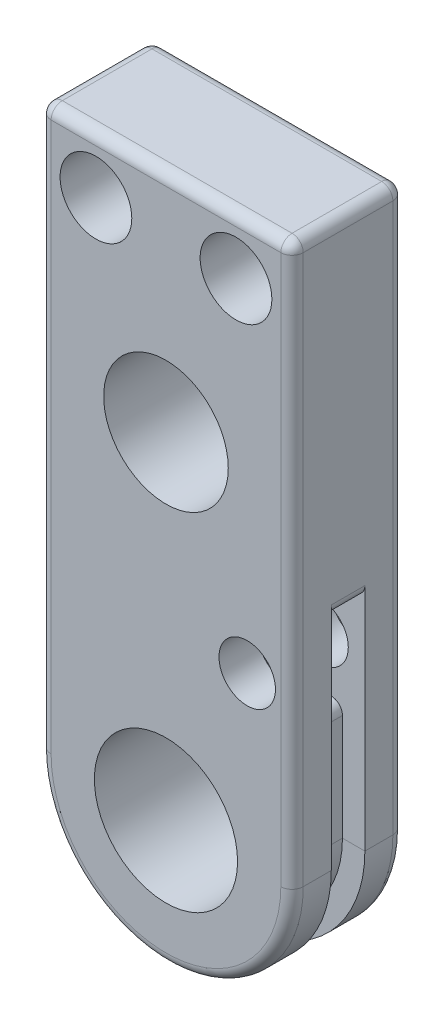
ISO-10303-21;
HEADER;
FILE_DESCRIPTION(('STEP AP214'),'2;1');
FILE_NAME('part.step','',(''),(''),'','','');
FILE_SCHEMA(('AUTOMOTIVE_DESIGN { 1 0 10303 214 1 1 1 1 }'));
ENDSEC;
DATA;
#1=APPLICATION_CONTEXT('core data for automotive mechanical design processes');
#2=APPLICATION_PROTOCOL_DEFINITION('international standard','automotive_design',2000,#1);
#3=PRODUCT_CONTEXT('',#1,'mechanical');
#4=PRODUCT('Part','Part','',(#3));
#5=PRODUCT_RELATED_PRODUCT_CATEGORY('part','',(#4));
#6=PRODUCT_DEFINITION_FORMATION('','',#4);
#7=PRODUCT_DEFINITION_CONTEXT('part definition',#1,'design');
#8=PRODUCT_DEFINITION('design','',#6,#7);
#9=PRODUCT_DEFINITION_SHAPE('','',#8);
#10=(LENGTH_UNIT() NAMED_UNIT(*) SI_UNIT(.MILLI.,.METRE.));
#11=(NAMED_UNIT(*) PLANE_ANGLE_UNIT() SI_UNIT($,.RADIAN.));
#12=(NAMED_UNIT(*) SI_UNIT($,.STERADIAN.) SOLID_ANGLE_UNIT());
#13=UNCERTAINTY_MEASURE_WITH_UNIT(LENGTH_MEASURE(1.E-05),#10,'distance_accuracy_value','');
#14=(GEOMETRIC_REPRESENTATION_CONTEXT(3) GLOBAL_UNCERTAINTY_ASSIGNED_CONTEXT((#13)) GLOBAL_UNIT_ASSIGNED_CONTEXT((#10,
#11,#12)) REPRESENTATION_CONTEXT('',''));
#15=CARTESIAN_POINT('',(0.,0.,0.));
#16=DIRECTION('',(0.,0.,1.));
#17=DIRECTION('',(1.,0.,0.));
#18=AXIS2_PLACEMENT_3D('',#15,#16,#17);
#19=CARTESIAN_POINT('',(0.,0.,3.175));
#20=DIRECTION('',(0.,0.,-1.));
#21=DIRECTION('',(-1.,0.,0.));
#22=AXIS2_PLACEMENT_3D('',#19,#20,#21);
#23=CYLINDRICAL_SURFACE('',#22,7.14375);
#24=DIRECTION('',(0.,0.,-1.));
#25=VECTOR('',#24,1.);
#26=CARTESIAN_POINT('',(7.14375,0.,3.175));
#27=LINE('',#26,#25);
#28=CARTESIAN_POINT('',(7.14375,0.,2.54));
#29=VERTEX_POINT('',#28);
#30=CARTESIAN_POINT('',(7.14374999999999,0.,0.9525));
#31=VERTEX_POINT('',#30);
#32=EDGE_CURVE('E321',#29,#31,#27,.T.);
#33=ORIENTED_EDGE('',*,*,#32,.F.);
#34=CARTESIAN_POINT('',(0.,0.,2.54));
#35=DIRECTION('',(0.,0.,1.));
#36=DIRECTION('',(1.,0.,0.));
#37=AXIS2_PLACEMENT_3D('',#34,#35,#36);
#38=CIRCLE('',#37,7.14375);
#39=CARTESIAN_POINT('',(-7.14375,0.,2.54));
#40=VERTEX_POINT('',#39);
#41=EDGE_CURVE('E365',#29,#40,#38,.F.);
#42=ORIENTED_EDGE('',*,*,#41,.T.);
#43=DIRECTION('',(0.,0.,-1.));
#44=VECTOR('',#43,1.);
#45=CARTESIAN_POINT('',(-7.14375,0.,3.175));
#46=LINE('',#45,#44);
#47=CARTESIAN_POINT('',(-7.14374999999999,0.,0.9525));
#48=VERTEX_POINT('',#47);
#49=EDGE_CURVE('E318',#40,#48,#46,.T.);
#50=ORIENTED_EDGE('',*,*,#49,.T.);
#51=CARTESIAN_POINT('',(0.,0.,0.9525));
#52=DIRECTION('',(0.,0.,1.));
#53=DIRECTION('',(-1.,0.,0.));
#54=AXIS2_PLACEMENT_3D('',#51,#52,#53);
#55=CIRCLE('',#54,7.14374999999999);
#56=EDGE_CURVE('E248',#48,#31,#55,.T.);
#57=ORIENTED_EDGE('',*,*,#56,.T.);
#58=EDGE_LOOP('',(#33,#42,#50,#57));
#59=FACE_BOUND('',#58,.T.);
#60=ADVANCED_FACE('F37',(#59),#23,.T.);
#61=CARTESIAN_POINT('',(7.14375,0.,3.175));
#62=DIRECTION('',(1.,0.,0.));
#63=DIRECTION('',(0.,1.,0.));
#64=AXIS2_PLACEMENT_3D('',#61,#62,#63);
#65=PLANE('',#64);
#66=DIRECTION('',(0.,-1.,0.));
#67=VECTOR('',#66,1.);
#68=CARTESIAN_POINT('',(7.14375,0.,0.9525));
#69=LINE('',#68,#67);
#70=CARTESIAN_POINT('',(7.14375,13.0302,0.9525));
#71=VERTEX_POINT('',#70);
#72=EDGE_CURVE('E259',#71,#31,#69,.T.);
#73=ORIENTED_EDGE('',*,*,#72,.F.);
#74=DIRECTION('',(0.,0.,1.));
#75=VECTOR('',#74,1.);
#76=CARTESIAN_POINT('',(7.14375,13.0302,3.175));
#77=LINE('',#76,#75);
#78=CARTESIAN_POINT('',(7.14375,13.0302,-0.9525));
#79=VERTEX_POINT('',#78);
#80=EDGE_CURVE('E424',#71,#79,#77,.F.);
#81=ORIENTED_EDGE('',*,*,#80,.T.);
#82=DIRECTION('',(0.,-1.,0.));
#83=VECTOR('',#82,1.);
#84=CARTESIAN_POINT('',(7.14375,0.,-0.9525));
#85=LINE('',#84,#83);
#86=CARTESIAN_POINT('',(7.14374999999999,0.,-0.952500000000001));
#87=VERTEX_POINT('',#86);
#88=EDGE_CURVE('E268',#79,#87,#85,.T.);
#89=ORIENTED_EDGE('',*,*,#88,.T.);
#90=CARTESIAN_POINT('',(7.14375,0.,-2.54));
#91=VERTEX_POINT('',#90);
#92=EDGE_CURVE('E320',#87,#91,#27,.T.);
#93=ORIENTED_EDGE('',*,*,#92,.T.);
#94=DIRECTION('',(0.,-1.,0.));
#95=VECTOR('',#94,1.);
#96=CARTESIAN_POINT('',(7.14374999999999,31.75,-2.54));
#97=LINE('',#96,#95);
#98=CARTESIAN_POINT('',(7.14374999999999,31.115,-2.54));
#99=VERTEX_POINT('',#98);
#100=EDGE_CURVE('E354',#91,#99,#97,.F.);
#101=ORIENTED_EDGE('',*,*,#100,.T.);
#102=DIRECTION('',(0.,0.,-1.));
#103=VECTOR('',#102,1.);
#104=CARTESIAN_POINT('',(7.14374999999999,31.115,3.175));
#105=LINE('',#104,#103);
#106=CARTESIAN_POINT('',(7.14374999999999,31.115,2.54));
#107=VERTEX_POINT('',#106);
#108=EDGE_CURVE('E352',#99,#107,#105,.F.);
#109=ORIENTED_EDGE('',*,*,#108,.T.);
#110=DIRECTION('',(0.,-1.,0.));
#111=VECTOR('',#110,1.);
#112=CARTESIAN_POINT('',(7.14375,0.,2.54));
#113=LINE('',#112,#111);
#114=EDGE_CURVE('E350',#107,#29,#113,.T.);
#115=ORIENTED_EDGE('',*,*,#114,.T.);
#116=ORIENTED_EDGE('',*,*,#32,.T.);
#117=EDGE_LOOP('',(#73,#81,#89,#93,#101,#109,#115,#116));
#118=FACE_BOUND('',#117,.T.);
#119=ADVANCED_FACE('F479',(#118),#65,.T.);
#120=CARTESIAN_POINT('',(4.60375000000001,9.525,3.175));
#121=DIRECTION('',(0.,0.,-1.));
#122=DIRECTION('',(-1.,0.,0.));
#123=AXIS2_PLACEMENT_3D('',#120,#121,#122);
#124=CYLINDRICAL_SURFACE('',#123,1.6002);
#125=CARTESIAN_POINT('',(4.60375000000001,9.525,-3.175));
#126=DIRECTION('',(0.,0.,1.));
#127=DIRECTION('',(1.,0.,0.));
#128=AXIS2_PLACEMENT_3D('',#125,#126,#127);
#129=CIRCLE('',#128,1.6002);
#130=CARTESIAN_POINT('',(6.20395000000001,9.525,-3.175));
#131=VERTEX_POINT('',#130);
#132=EDGE_CURVE('E292',#131,#131,#129,.T.);
#133=ORIENTED_EDGE('',*,*,#132,.F.);
#134=EDGE_LOOP('',(#133));
#135=FACE_BOUND('',#134,.T.);
#136=CARTESIAN_POINT('',(4.60375000000001,9.525,-0.9525));
#137=DIRECTION('',(0.,0.,1.));
#138=DIRECTION('',(1.,0.,0.));
#139=AXIS2_PLACEMENT_3D('',#136,#137,#138);
#140=CIRCLE('',#139,1.6002);
#141=CARTESIAN_POINT('',(6.20395000000001,9.525,-0.9525));
#142=VERTEX_POINT('',#141);
#143=EDGE_CURVE('E255',#142,#142,#140,.T.);
#144=ORIENTED_EDGE('',*,*,#143,.T.);
#145=EDGE_LOOP('',(#144));
#146=FACE_BOUND('',#145,.T.);
#147=ADVANCED_FACE('F545',(#135,#146),#124,.F.);
#148=CARTESIAN_POINT('',(-7.14374999999999,0.,-0.9525));
#149=VERTEX_POINT('',#148);
#150=CARTESIAN_POINT('',(-7.14375,0.,-2.54));
#151=VERTEX_POINT('',#150);
#152=EDGE_CURVE('E304',#149,#151,#46,.T.);
#153=ORIENTED_EDGE('',*,*,#152,.T.);
#154=CARTESIAN_POINT('',(0.,0.,-2.54));
#155=DIRECTION('',(0.,0.,1.));
#156=DIRECTION('',(1.,0.,0.));
#157=AXIS2_PLACEMENT_3D('',#154,#155,#156);
#158=CIRCLE('',#157,7.14375);
#159=EDGE_CURVE('E339',#151,#91,#158,.T.);
#160=ORIENTED_EDGE('',*,*,#159,.T.);
#161=ORIENTED_EDGE('',*,*,#92,.F.);
#162=CARTESIAN_POINT('',(0.,0.,-0.9525));
#163=DIRECTION('',(0.,0.,1.));
#164=DIRECTION('',(-1.,0.,0.));
#165=AXIS2_PLACEMENT_3D('',#162,#163,#164);
#166=CIRCLE('',#165,7.14374999999999);
#167=EDGE_CURVE('E251',#149,#87,#166,.T.);
#168=ORIENTED_EDGE('',*,*,#167,.F.);
#169=EDGE_LOOP('',(#153,#160,#161,#168));
#170=FACE_BOUND('',#169,.T.);
#171=ADVANCED_FACE('F473',(#170),#23,.T.);
#172=CARTESIAN_POINT('',(0.,31.75,3.175));
#173=DIRECTION('',(0.,1.,0.));
#174=DIRECTION('',(-1.,0.,0.));
#175=AXIS2_PLACEMENT_3D('',#172,#173,#174);
#176=PLANE('',#175);
#177=DIRECTION('',(1.,0.,0.));
#178=VECTOR('',#177,1.);
#179=CARTESIAN_POINT('',(0.,31.75,2.54));
#180=LINE('',#179,#178);
#181=CARTESIAN_POINT('',(-6.50875,31.75,2.54));
#182=VERTEX_POINT('',#181);
#183=CARTESIAN_POINT('',(6.50874999999999,31.75,2.54));
#184=VERTEX_POINT('',#183);
#185=EDGE_CURVE('E345',#182,#184,#180,.T.);
#186=ORIENTED_EDGE('',*,*,#185,.T.);
#187=DIRECTION('',(0.,0.,-1.));
#188=VECTOR('',#187,1.);
#189=CARTESIAN_POINT('',(6.50874999999999,31.75,3.175));
#190=LINE('',#189,#188);
#191=CARTESIAN_POINT('',(6.50874999999999,31.75,-2.54));
#192=VERTEX_POINT('',#191);
#193=EDGE_CURVE('E347',#184,#192,#190,.T.);
#194=ORIENTED_EDGE('',*,*,#193,.T.);
#195=DIRECTION('',(1.,0.,0.));
#196=VECTOR('',#195,1.);
#197=CARTESIAN_POINT('',(-7.14375,31.75,-2.54));
#198=LINE('',#197,#196);
#199=CARTESIAN_POINT('',(-6.50875,31.75,-2.54));
#200=VERTEX_POINT('',#199);
#201=EDGE_CURVE('E341',#192,#200,#198,.F.);
#202=ORIENTED_EDGE('',*,*,#201,.T.);
#203=DIRECTION('',(0.,0.,-1.));
#204=VECTOR('',#203,1.);
#205=CARTESIAN_POINT('',(-6.50875,31.75,3.175));
#206=LINE('',#205,#204);
#207=EDGE_CURVE('E343',#200,#182,#206,.F.);
#208=ORIENTED_EDGE('',*,*,#207,.T.);
#209=EDGE_LOOP('',(#186,#194,#202,#208));
#210=FACE_BOUND('',#209,.T.);
#211=ADVANCED_FACE('F506',(#210),#176,.T.);
#212=CARTESIAN_POINT('',(0.,0.,3.175));
#213=DIRECTION('',(0.,0.,-1.));
#214=DIRECTION('',(-1.,0.,0.));
#215=AXIS2_PLACEMENT_3D('',#212,#213,#214);
#216=CYLINDRICAL_SURFACE('',#215,4.05765);
#217=CARTESIAN_POINT('',(0.,0.,3.175));
#218=DIRECTION('',(0.,0.,1.));
#219=DIRECTION('',(1.,0.,0.));
#220=AXIS2_PLACEMENT_3D('',#217,#218,#219);
#221=CIRCLE('',#220,4.05765);
#222=CARTESIAN_POINT('',(4.05765,0.,3.175));
#223=VERTEX_POINT('',#222);
#224=EDGE_CURVE('E298',#223,#223,#221,.T.);
#225=ORIENTED_EDGE('',*,*,#224,.T.);
#226=EDGE_LOOP('',(#225));
#227=FACE_BOUND('',#226,.T.);
#228=CARTESIAN_POINT('',(0.,0.,-3.175));
#229=DIRECTION('',(0.,0.,1.));
#230=DIRECTION('',(1.,0.,0.));
#231=AXIS2_PLACEMENT_3D('',#228,#229,#230);
#232=CIRCLE('',#231,4.05765);
#233=CARTESIAN_POINT('',(4.05765,0.,-3.175));
#234=VERTEX_POINT('',#233);
#235=EDGE_CURVE('E313',#234,#234,#232,.T.);
#236=ORIENTED_EDGE('',*,*,#235,.F.);
#237=EDGE_LOOP('',(#236));
#238=FACE_BOUND('',#237,.T.);
#239=ADVANCED_FACE('F553',(#227,#238),#216,.F.);
#240=CARTESIAN_POINT('',(0.,19.05,3.175));
#241=DIRECTION('',(0.,0.,-1.));
#242=DIRECTION('',(-1.,0.,0.));
#243=AXIS2_PLACEMENT_3D('',#240,#241,#242);
#244=CYLINDRICAL_SURFACE('',#243,3.5306);
#245=CARTESIAN_POINT('',(0.,19.05,3.175));
#246=DIRECTION('',(0.,0.,1.));
#247=DIRECTION('',(1.,0.,0.));
#248=AXIS2_PLACEMENT_3D('',#245,#246,#247);
#249=CIRCLE('',#248,3.5306);
#250=CARTESIAN_POINT('',(3.5306,19.05,3.175));
#251=VERTEX_POINT('',#250);
#252=EDGE_CURVE('E295',#251,#251,#249,.T.);
#253=ORIENTED_EDGE('',*,*,#252,.T.);
#254=EDGE_LOOP('',(#253));
#255=FACE_BOUND('',#254,.T.);
#256=CARTESIAN_POINT('',(0.,19.05,-3.175));
#257=DIRECTION('',(0.,0.,1.));
#258=DIRECTION('',(1.,0.,0.));
#259=AXIS2_PLACEMENT_3D('',#256,#257,#258);
#260=CIRCLE('',#259,3.5306);
#261=CARTESIAN_POINT('',(3.5306,19.05,-3.175));
#262=VERTEX_POINT('',#261);
#263=EDGE_CURVE('E310',#262,#262,#260,.T.);
#264=ORIENTED_EDGE('',*,*,#263,.F.);
#265=EDGE_LOOP('',(#264));
#266=FACE_BOUND('',#265,.T.);
#267=ADVANCED_FACE('F740',(#255,#266),#244,.F.);
#268=CARTESIAN_POINT('',(3.96875,28.575,3.175));
#269=DIRECTION('',(0.,0.,-1.));
#270=DIRECTION('',(-1.,0.,0.));
#271=AXIS2_PLACEMENT_3D('',#268,#269,#270);
#272=CYLINDRICAL_SURFACE('',#271,2.032);
#273=CARTESIAN_POINT('',(3.96875,28.575,3.175));
#274=DIRECTION('',(0.,0.,1.));
#275=DIRECTION('',(1.,0.,0.));
#276=AXIS2_PLACEMENT_3D('',#273,#274,#275);
#277=CIRCLE('',#276,2.032);
#278=CARTESIAN_POINT('',(6.00075,28.575,3.175));
#279=VERTEX_POINT('',#278);
#280=EDGE_CURVE('E291',#279,#279,#277,.T.);
#281=ORIENTED_EDGE('',*,*,#280,.T.);
#282=EDGE_LOOP('',(#281));
#283=FACE_BOUND('',#282,.T.);
#284=CARTESIAN_POINT('',(3.96875,28.575,-3.175));
#285=DIRECTION('',(0.,0.,1.));
#286=DIRECTION('',(1.,0.,0.));
#287=AXIS2_PLACEMENT_3D('',#284,#285,#286);
#288=CIRCLE('',#287,2.032);
#289=CARTESIAN_POINT('',(6.00075,28.575,-3.175));
#290=VERTEX_POINT('',#289);
#291=EDGE_CURVE('E307',#290,#290,#288,.T.);
#292=ORIENTED_EDGE('',*,*,#291,.F.);
#293=EDGE_LOOP('',(#292));
#294=FACE_BOUND('',#293,.T.);
#295=ADVANCED_FACE('F733',(#283,#294),#272,.F.);
#296=CARTESIAN_POINT('',(-3.96875,28.575,3.175));
#297=DIRECTION('',(0.,0.,-1.));
#298=DIRECTION('',(-1.,0.,0.));
#299=AXIS2_PLACEMENT_3D('',#296,#297,#298);
#300=CYLINDRICAL_SURFACE('',#299,2.032);
#301=CARTESIAN_POINT('',(-3.96875,28.575,3.175));
#302=DIRECTION('',(0.,0.,1.));
#303=DIRECTION('',(1.,0.,0.));
#304=AXIS2_PLACEMENT_3D('',#301,#302,#303);
#305=CIRCLE('',#304,2.032);
#306=CARTESIAN_POINT('',(-1.93675,28.575,3.175));
#307=VERTEX_POINT('',#306);
#308=EDGE_CURVE('E288',#307,#307,#305,.T.);
#309=ORIENTED_EDGE('',*,*,#308,.T.);
#310=EDGE_LOOP('',(#309));
#311=FACE_BOUND('',#310,.T.);
#312=CARTESIAN_POINT('',(-3.96875,28.575,-3.175));
#313=DIRECTION('',(0.,0.,1.));
#314=DIRECTION('',(1.,0.,0.));
#315=AXIS2_PLACEMENT_3D('',#312,#313,#314);
#316=CIRCLE('',#315,2.032);
#317=CARTESIAN_POINT('',(-1.93675,28.575,-3.175));
#318=VERTEX_POINT('',#317);
#319=EDGE_CURVE('E286',#318,#318,#316,.T.);
#320=ORIENTED_EDGE('',*,*,#319,.F.);
#321=EDGE_LOOP('',(#320));
#322=FACE_BOUND('',#321,.T.);
#323=ADVANCED_FACE('F573',(#311,#322),#300,.F.);
#324=CARTESIAN_POINT('',(-7.14375,0.,3.175));
#325=DIRECTION('',(-1.,0.,0.));
#326=DIRECTION('',(0.,-1.,0.));
#327=AXIS2_PLACEMENT_3D('',#324,#325,#326);
#328=PLANE('',#327);
#329=DIRECTION('',(0.,-1.,0.));
#330=VECTOR('',#329,1.);
#331=CARTESIAN_POINT('',(-7.14374999999999,6.35,-0.9525));
#332=LINE('',#331,#330);
#333=CARTESIAN_POINT('',(-7.14375,6.985,-0.9525));
#334=VERTEX_POINT('',#333);
#335=EDGE_CURVE('E53',#334,#149,#332,.T.);
#336=ORIENTED_EDGE('',*,*,#335,.F.);
#337=DIRECTION('',(0.,0.,-1.));
#338=VECTOR('',#337,1.);
#339=CARTESIAN_POINT('',(-7.14375,6.985,0.9525));
#340=LINE('',#339,#338);
#341=CARTESIAN_POINT('',(-7.14374999999999,6.985,0.9525));
#342=VERTEX_POINT('',#341);
#343=EDGE_CURVE('E427',#334,#342,#340,.F.);
#344=ORIENTED_EDGE('',*,*,#343,.T.);
#345=DIRECTION('',(0.,-1.,0.));
#346=VECTOR('',#345,1.);
#347=CARTESIAN_POINT('',(-7.14374999999999,6.35,0.9525));
#348=LINE('',#347,#346);
#349=EDGE_CURVE('E60',#342,#48,#348,.T.);
#350=ORIENTED_EDGE('',*,*,#349,.T.);
#351=ORIENTED_EDGE('',*,*,#49,.F.);
#352=DIRECTION('',(0.,1.,0.));
#353=VECTOR('',#352,1.);
#354=CARTESIAN_POINT('',(-7.14375,0.,2.54));
#355=LINE('',#354,#353);
#356=CARTESIAN_POINT('',(-7.14375,31.115,2.54));
#357=VERTEX_POINT('',#356);
#358=EDGE_CURVE('E332',#40,#357,#355,.T.);
#359=ORIENTED_EDGE('',*,*,#358,.T.);
#360=DIRECTION('',(0.,0.,-1.));
#361=VECTOR('',#360,1.);
#362=CARTESIAN_POINT('',(-7.14375,31.115,3.175));
#363=LINE('',#362,#361);
#364=CARTESIAN_POINT('',(-7.14375,31.115,-2.54));
#365=VERTEX_POINT('',#364);
#366=EDGE_CURVE('E334',#357,#365,#363,.T.);
#367=ORIENTED_EDGE('',*,*,#366,.T.);
#368=DIRECTION('',(0.,1.,0.));
#369=VECTOR('',#368,1.);
#370=CARTESIAN_POINT('',(-7.14375,0.,-2.54));
#371=LINE('',#370,#369);
#372=EDGE_CURVE('E336',#365,#151,#371,.F.);
#373=ORIENTED_EDGE('',*,*,#372,.T.);
#374=ORIENTED_EDGE('',*,*,#152,.F.);
#375=EDGE_LOOP('',(#336,#344,#350,#351,#359,#367,#373,#374));
#376=FACE_BOUND('',#375,.T.);
#377=ADVANCED_FACE('F445',(#376),#328,.T.);
#378=CARTESIAN_POINT('',(4.60375000000001,9.525,0.9525));
#379=DIRECTION('',(0.,0.,1.));
#380=DIRECTION('',(1.,0.,0.));
#381=AXIS2_PLACEMENT_3D('',#378,#379,#380);
#382=CIRCLE('',#381,1.6002);
#383=CARTESIAN_POINT('',(6.20395000000001,9.525,0.9525));
#384=VERTEX_POINT('',#383);
#385=EDGE_CURVE('E240',#384,#384,#382,.T.);
#386=ORIENTED_EDGE('',*,*,#385,.F.);
#387=EDGE_LOOP('',(#386));
#388=FACE_BOUND('',#387,.T.);
#389=CARTESIAN_POINT('',(4.60375000000001,9.525,3.175));
#390=DIRECTION('',(0.,0.,1.));
#391=DIRECTION('',(1.,0.,0.));
#392=AXIS2_PLACEMENT_3D('',#389,#390,#391);
#393=CIRCLE('',#392,1.6002);
#394=CARTESIAN_POINT('',(6.20395000000001,9.525,3.175));
#395=VERTEX_POINT('',#394);
#396=EDGE_CURVE('E301',#395,#395,#393,.T.);
#397=ORIENTED_EDGE('',*,*,#396,.T.);
#398=EDGE_LOOP('',(#397));
#399=FACE_BOUND('',#398,.T.);
#400=ADVANCED_FACE('F557',(#388,#399),#124,.F.);
#401=CARTESIAN_POINT('',(0.,0.,3.175));
#402=DIRECTION('',(0.,0.,1.));
#403=DIRECTION('',(1.,0.,0.));
#404=AXIS2_PLACEMENT_3D('',#401,#402,#403);
#405=PLANE('',#404);
#406=DIRECTION('',(1.,0.,0.));
#407=VECTOR('',#406,1.);
#408=CARTESIAN_POINT('',(0.,31.115,3.175));
#409=LINE('',#408,#407);
#410=CARTESIAN_POINT('',(6.50874999999999,31.115,3.175));
#411=VERTEX_POINT('',#410);
#412=CARTESIAN_POINT('',(-6.50875,31.115,3.175));
#413=VERTEX_POINT('',#412);
#414=EDGE_CURVE('E360',#411,#413,#409,.F.);
#415=ORIENTED_EDGE('',*,*,#414,.T.);
#416=DIRECTION('',(0.,1.,0.));
#417=VECTOR('',#416,1.);
#418=CARTESIAN_POINT('',(-6.50875,0.,3.175));
#419=LINE('',#418,#417);
#420=CARTESIAN_POINT('',(-6.50875,0.,3.175));
#421=VERTEX_POINT('',#420);
#422=EDGE_CURVE('E363',#413,#421,#419,.F.);
#423=ORIENTED_EDGE('',*,*,#422,.T.);
#424=CARTESIAN_POINT('',(0.,0.,3.175));
#425=DIRECTION('',(0.,0.,1.));
#426=DIRECTION('',(1.,0.,0.));
#427=AXIS2_PLACEMENT_3D('',#424,#425,#426);
#428=CIRCLE('',#427,6.50875);
#429=CARTESIAN_POINT('',(6.50875,0.,3.175));
#430=VERTEX_POINT('',#429);
#431=EDGE_CURVE('E358',#421,#430,#428,.T.);
#432=ORIENTED_EDGE('',*,*,#431,.T.);
#433=DIRECTION('',(0.,-1.,0.));
#434=VECTOR('',#433,1.);
#435=CARTESIAN_POINT('',(6.50875,0.,3.175));
#436=LINE('',#435,#434);
#437=EDGE_CURVE('E356',#430,#411,#436,.F.);
#438=ORIENTED_EDGE('',*,*,#437,.T.);
#439=EDGE_LOOP('',(#415,#423,#432,#438));
#440=FACE_BOUND('',#439,.T.);
#441=ORIENTED_EDGE('',*,*,#308,.F.);
#442=EDGE_LOOP('',(#441));
#443=FACE_BOUND('',#442,.T.);
#444=ORIENTED_EDGE('',*,*,#280,.F.);
#445=EDGE_LOOP('',(#444));
#446=FACE_BOUND('',#445,.T.);
#447=ORIENTED_EDGE('',*,*,#252,.F.);
#448=EDGE_LOOP('',(#447));
#449=FACE_BOUND('',#448,.T.);
#450=ORIENTED_EDGE('',*,*,#224,.F.);
#451=EDGE_LOOP('',(#450));
#452=FACE_BOUND('',#451,.T.);
#453=ORIENTED_EDGE('',*,*,#396,.F.);
#454=EDGE_LOOP('',(#453));
#455=FACE_BOUND('',#454,.T.);
#456=ADVANCED_FACE('F565',(#440,#443,#446,#449,#452,#455),#405,.T.);
#457=CARTESIAN_POINT('',(0.,0.,-3.175));
#458=DIRECTION('',(0.,0.,1.));
#459=DIRECTION('',(1.,0.,0.));
#460=AXIS2_PLACEMENT_3D('',#457,#458,#459);
#461=PLANE('',#460);
#462=CARTESIAN_POINT('',(0.,0.,-3.175));
#463=DIRECTION('',(0.,0.,1.));
#464=DIRECTION('',(1.,0.,0.));
#465=AXIS2_PLACEMENT_3D('',#462,#463,#464);
#466=CIRCLE('',#465,6.50875);
#467=CARTESIAN_POINT('',(6.50875,0.,-3.175));
#468=VERTEX_POINT('',#467);
#469=CARTESIAN_POINT('',(-6.50875,0.,-3.175));
#470=VERTEX_POINT('',#469);
#471=EDGE_CURVE('E327',#468,#470,#466,.F.);
#472=ORIENTED_EDGE('',*,*,#471,.T.);
#473=DIRECTION('',(0.,1.,0.));
#474=VECTOR('',#473,1.);
#475=CARTESIAN_POINT('',(-6.50875,31.75,-3.175));
#476=LINE('',#475,#474);
#477=CARTESIAN_POINT('',(-6.50875,31.115,-3.175));
#478=VERTEX_POINT('',#477);
#479=EDGE_CURVE('E329',#470,#478,#476,.T.);
#480=ORIENTED_EDGE('',*,*,#479,.T.);
#481=DIRECTION('',(1.,0.,0.));
#482=VECTOR('',#481,1.);
#483=CARTESIAN_POINT('',(7.14374999999999,31.115,-3.175));
#484=LINE('',#483,#482);
#485=CARTESIAN_POINT('',(6.50874999999999,31.115,-3.175));
#486=VERTEX_POINT('',#485);
#487=EDGE_CURVE('E325',#478,#486,#484,.T.);
#488=ORIENTED_EDGE('',*,*,#487,.T.);
#489=DIRECTION('',(0.,-1.,0.));
#490=VECTOR('',#489,1.);
#491=CARTESIAN_POINT('',(6.50875,0.,-3.175));
#492=LINE('',#491,#490);
#493=EDGE_CURVE('E323',#486,#468,#492,.T.);
#494=ORIENTED_EDGE('',*,*,#493,.T.);
#495=EDGE_LOOP('',(#472,#480,#488,#494));
#496=FACE_BOUND('',#495,.T.);
#497=ORIENTED_EDGE('',*,*,#319,.T.);
#498=EDGE_LOOP('',(#497));
#499=FACE_BOUND('',#498,.T.);
#500=ORIENTED_EDGE('',*,*,#291,.T.);
#501=EDGE_LOOP('',(#500));
#502=FACE_BOUND('',#501,.T.);
#503=ORIENTED_EDGE('',*,*,#263,.T.);
#504=EDGE_LOOP('',(#503));
#505=FACE_BOUND('',#504,.T.);
#506=ORIENTED_EDGE('',*,*,#235,.T.);
#507=EDGE_LOOP('',(#506));
#508=FACE_BOUND('',#507,.T.);
#509=ORIENTED_EDGE('',*,*,#132,.T.);
#510=EDGE_LOOP('',(#509));
#511=FACE_BOUND('',#510,.T.);
#512=ADVANCED_FACE('F492',(#496,#499,#502,#505,#508,#511),#461,.F.);
#513=CARTESIAN_POINT('',(0.,12.3952,-0.9525));
#514=DIRECTION('',(0.,-1.,0.));
#515=DIRECTION('',(0.,0.,-1.));
#516=AXIS2_PLACEMENT_3D('',#513,#514,#515);
#517=PLANE('',#516);
#518=DIRECTION('',(1.,0.,0.));
#519=VECTOR('',#518,1.);
#520=CARTESIAN_POINT('',(0.,12.3952,-0.9525));
#521=LINE('',#520,#519);
#522=CARTESIAN_POINT('',(4.60375000000001,12.3952,-0.9525));
#523=VERTEX_POINT('',#522);
#524=CARTESIAN_POINT('',(6.50875,12.3952,-0.9525));
#525=VERTEX_POINT('',#524);
#526=EDGE_CURVE('E258',#523,#525,#521,.T.);
#527=ORIENTED_EDGE('',*,*,#526,.T.);
#528=DIRECTION('',(0.,0.,1.));
#529=VECTOR('',#528,1.);
#530=CARTESIAN_POINT('',(6.50875,12.3952,-0.9525));
#531=LINE('',#530,#529);
#532=CARTESIAN_POINT('',(6.50875,12.3952,0.9525));
#533=VERTEX_POINT('',#532);
#534=EDGE_CURVE('E421',#525,#533,#531,.T.);
#535=ORIENTED_EDGE('',*,*,#534,.T.);
#536=DIRECTION('',(1.,0.,0.));
#537=VECTOR('',#536,1.);
#538=CARTESIAN_POINT('',(0.,12.3952,0.9525));
#539=LINE('',#538,#537);
#540=CARTESIAN_POINT('',(4.60375000000001,12.3952,0.9525));
#541=VERTEX_POINT('',#540);
#542=EDGE_CURVE('E273',#541,#533,#539,.T.);
#543=ORIENTED_EDGE('',*,*,#542,.F.);
#544=DIRECTION('',(0.,0.,1.));
#545=VECTOR('',#544,1.);
#546=CARTESIAN_POINT('',(4.60375000000001,12.3952,-0.9525));
#547=LINE('',#546,#545);
#548=EDGE_CURVE('E270',#523,#541,#547,.T.);
#549=ORIENTED_EDGE('',*,*,#548,.F.);
#550=EDGE_LOOP('',(#527,#535,#543,#549));
#551=FACE_BOUND('',#550,.T.);
#552=ADVANCED_FACE('F591',(#551),#517,.T.);
#553=CARTESIAN_POINT('',(0.,6.6548,-0.9525));
#554=DIRECTION('',(0.,-1.,0.));
#555=DIRECTION('',(0.,0.,-1.));
#556=AXIS2_PLACEMENT_3D('',#553,#554,#555);
#557=PLANE('',#556);
#558=DIRECTION('',(1.,0.,0.));
#559=VECTOR('',#558,1.);
#560=CARTESIAN_POINT('',(0.,6.6548,0.9525));
#561=LINE('',#560,#559);
#562=CARTESIAN_POINT('',(4.60375000000001,6.6548,0.9525));
#563=VERTEX_POINT('',#562);
#564=CARTESIAN_POINT('',(5.23875,6.6548,0.9525));
#565=VERTEX_POINT('',#564);
#566=EDGE_CURVE('E279',#563,#565,#561,.T.);
#567=ORIENTED_EDGE('',*,*,#566,.T.);
#568=DIRECTION('',(0.,0.,1.));
#569=VECTOR('',#568,1.);
#570=CARTESIAN_POINT('',(5.23875,6.6548,-0.9525));
#571=LINE('',#570,#569);
#572=CARTESIAN_POINT('',(5.23875,6.6548,-0.9525));
#573=VERTEX_POINT('',#572);
#574=EDGE_CURVE('E419',#565,#573,#571,.F.);
#575=ORIENTED_EDGE('',*,*,#574,.T.);
#576=DIRECTION('',(1.,0.,0.));
#577=VECTOR('',#576,1.);
#578=CARTESIAN_POINT('',(0.,6.6548,-0.9525));
#579=LINE('',#578,#577);
#580=CARTESIAN_POINT('',(4.60375000000001,6.6548,-0.9525));
#581=VERTEX_POINT('',#580);
#582=EDGE_CURVE('E265',#581,#573,#579,.T.);
#583=ORIENTED_EDGE('',*,*,#582,.F.);
#584=DIRECTION('',(0.,0.,1.));
#585=VECTOR('',#584,1.);
#586=CARTESIAN_POINT('',(4.60375000000001,6.6548,-0.9525));
#587=LINE('',#586,#585);
#588=EDGE_CURVE('E284',#581,#563,#587,.T.);
#589=ORIENTED_EDGE('',*,*,#588,.T.);
#590=EDGE_LOOP('',(#567,#575,#583,#589));
#591=FACE_BOUND('',#590,.T.);
#592=ADVANCED_FACE('F601',(#591),#557,.F.);
#593=CARTESIAN_POINT('',(4.60375000000001,9.525,-0.9525));
#594=DIRECTION('',(0.,0.,1.));
#595=DIRECTION('',(1.,0.,0.));
#596=AXIS2_PLACEMENT_3D('',#593,#594,#595);
#597=CYLINDRICAL_SURFACE('',#596,2.8702);
#598=CARTESIAN_POINT('',(4.60375000000001,9.525,0.9525));
#599=DIRECTION('',(0.,0.,1.));
#600=DIRECTION('',(1.,0.,0.));
#601=AXIS2_PLACEMENT_3D('',#598,#599,#600);
#602=CIRCLE('',#601,2.8702);
#603=EDGE_CURVE('E276',#541,#563,#602,.T.);
#604=ORIENTED_EDGE('',*,*,#603,.T.);
#605=ORIENTED_EDGE('',*,*,#588,.F.);
#606=CARTESIAN_POINT('',(4.60375000000001,9.525,-0.9525));
#607=DIRECTION('',(0.,0.,1.));
#608=DIRECTION('',(1.,0.,0.));
#609=AXIS2_PLACEMENT_3D('',#606,#607,#608);
#610=CIRCLE('',#609,2.8702);
#611=EDGE_CURVE('E262',#523,#581,#610,.T.);
#612=ORIENTED_EDGE('',*,*,#611,.F.);
#613=ORIENTED_EDGE('',*,*,#548,.T.);
#614=EDGE_LOOP('',(#604,#605,#612,#613));
#615=FACE_BOUND('',#614,.T.);
#616=ADVANCED_FACE('F605',(#615),#597,.F.);
#617=CARTESIAN_POINT('',(0.,0.,-0.9525));
#618=DIRECTION('',(0.,0.,1.));
#619=DIRECTION('',(1.,0.,0.));
#620=AXIS2_PLACEMENT_3D('',#617,#618,#619);
#621=PLANE('',#620);
#622=ORIENTED_EDGE('',*,*,#143,.F.);
#623=EDGE_LOOP('',(#622));
#624=FACE_BOUND('',#623,.T.);
#625=ORIENTED_EDGE('',*,*,#526,.F.);
#626=ORIENTED_EDGE('',*,*,#611,.T.);
#627=ORIENTED_EDGE('',*,*,#582,.T.);
#628=CARTESIAN_POINT('',(5.23875,6.0198,-0.9525));
#629=DIRECTION('',(0.,0.,1.));
#630=DIRECTION('',(1.,0.,0.));
#631=AXIS2_PLACEMENT_3D('',#628,#629,#630);
#632=CIRCLE('',#631,0.635);
#633=CARTESIAN_POINT('',(5.87375,6.0198,-0.9525));
#634=VERTEX_POINT('',#633);
#635=EDGE_CURVE('E431',#573,#634,#632,.F.);
#636=ORIENTED_EDGE('',*,*,#635,.T.);
#637=DIRECTION('',(0.,1.,0.));
#638=VECTOR('',#637,1.);
#639=CARTESIAN_POINT('',(5.87374999999999,0.,-0.9525));
#640=LINE('',#639,#638);
#641=CARTESIAN_POINT('',(5.87374999999999,0.,-0.952499999999999));
#642=VERTEX_POINT('',#641);
#643=EDGE_CURVE('E241',#642,#634,#640,.T.);
#644=ORIENTED_EDGE('',*,*,#643,.F.);
#645=DIRECTION('',(-1.,0.,0.));
#646=VECTOR('',#645,1.);
#647=CARTESIAN_POINT('',(7.14375,0.,-0.9525));
#648=LINE('',#647,#646);
#649=EDGE_CURVE('E215',#87,#642,#648,.T.);
#650=ORIENTED_EDGE('',*,*,#649,.F.);
#651=ORIENTED_EDGE('',*,*,#88,.F.);
#652=CARTESIAN_POINT('',(6.50875,13.0302,-0.9525));
#653=DIRECTION('',(0.,0.,1.));
#654=DIRECTION('',(1.,0.,0.));
#655=AXIS2_PLACEMENT_3D('',#652,#653,#654);
#656=CIRCLE('',#655,0.635);
#657=EDGE_CURVE('E436',#79,#525,#656,.F.);
#658=ORIENTED_EDGE('',*,*,#657,.T.);
#659=EDGE_LOOP('',(#625,#626,#627,#636,#644,#650,#651,#658));
#660=FACE_BOUND('',#659,.T.);
#661=ADVANCED_FACE('F583',(#624,#660),#621,.T.);
#662=CARTESIAN_POINT('',(0.,0.,0.9525));
#663=DIRECTION('',(0.,0.,1.));
#664=DIRECTION('',(1.,0.,0.));
#665=AXIS2_PLACEMENT_3D('',#662,#663,#664);
#666=PLANE('',#665);
#667=ORIENTED_EDGE('',*,*,#385,.T.);
#668=EDGE_LOOP('',(#667));
#669=FACE_BOUND('',#668,.T.);
#670=ORIENTED_EDGE('',*,*,#542,.T.);
#671=CARTESIAN_POINT('',(6.50875,13.0302,0.9525));
#672=DIRECTION('',(0.,0.,1.));
#673=DIRECTION('',(1.,0.,0.));
#674=AXIS2_PLACEMENT_3D('',#671,#672,#673);
#675=CIRCLE('',#674,0.635);
#676=EDGE_CURVE('E433',#533,#71,#675,.T.);
#677=ORIENTED_EDGE('',*,*,#676,.T.);
#678=ORIENTED_EDGE('',*,*,#72,.T.);
#679=DIRECTION('',(1.,0.,0.));
#680=VECTOR('',#679,1.);
#681=CARTESIAN_POINT('',(7.14375,0.,0.9525));
#682=LINE('',#681,#680);
#683=CARTESIAN_POINT('',(5.87374999999999,0.,0.9525));
#684=VERTEX_POINT('',#683);
#685=EDGE_CURVE('E235',#684,#31,#682,.T.);
#686=ORIENTED_EDGE('',*,*,#685,.F.);
#687=DIRECTION('',(0.,1.,0.));
#688=VECTOR('',#687,1.);
#689=CARTESIAN_POINT('',(5.87374999999999,0.,0.9525));
#690=LINE('',#689,#688);
#691=CARTESIAN_POINT('',(5.87375,6.0198,0.9525));
#692=VERTEX_POINT('',#691);
#693=EDGE_CURVE('E237',#684,#692,#690,.T.);
#694=ORIENTED_EDGE('',*,*,#693,.T.);
#695=CARTESIAN_POINT('',(5.23875,6.0198,0.9525));
#696=DIRECTION('',(0.,0.,1.));
#697=DIRECTION('',(1.,0.,0.));
#698=AXIS2_PLACEMENT_3D('',#695,#696,#697);
#699=CIRCLE('',#698,0.635);
#700=EDGE_CURVE('E429',#692,#565,#699,.T.);
#701=ORIENTED_EDGE('',*,*,#700,.T.);
#702=ORIENTED_EDGE('',*,*,#566,.F.);
#703=ORIENTED_EDGE('',*,*,#603,.F.);
#704=EDGE_LOOP('',(#670,#677,#678,#686,#694,#701,#702,#703));
#705=FACE_BOUND('',#704,.T.);
#706=ADVANCED_FACE('F580',(#669,#705),#666,.F.);
#707=CARTESIAN_POINT('',(-5.87374999999999,6.35,-0.9525));
#708=DIRECTION('',(1.,0.,0.));
#709=DIRECTION('',(0.,0.,-1.));
#710=AXIS2_PLACEMENT_3D('',#707,#708,#709);
#711=PLANE('',#710);
#712=DIRECTION('',(0.,-1.,0.));
#713=VECTOR('',#712,1.);
#714=CARTESIAN_POINT('',(-5.87374999999999,6.35,0.9525));
#715=LINE('',#714,#713);
#716=CARTESIAN_POINT('',(-5.87374999999999,5.715,0.9525));
#717=VERTEX_POINT('',#716);
#718=CARTESIAN_POINT('',(-5.87374999999999,0.,0.9525));
#719=VERTEX_POINT('',#718);
#720=EDGE_CURVE('E229',#717,#719,#715,.T.);
#721=ORIENTED_EDGE('',*,*,#720,.F.);
#722=DIRECTION('',(0.,0.,1.));
#723=VECTOR('',#722,1.);
#724=CARTESIAN_POINT('',(-5.87374999999999,5.715,-0.9525));
#725=LINE('',#724,#723);
#726=CARTESIAN_POINT('',(-5.87374999999999,5.715,-0.9525));
#727=VERTEX_POINT('',#726);
#728=EDGE_CURVE('E202',#717,#727,#725,.F.);
#729=ORIENTED_EDGE('',*,*,#728,.T.);
#730=DIRECTION('',(0.,-1.,0.));
#731=VECTOR('',#730,1.);
#732=CARTESIAN_POINT('',(-5.87374999999999,6.35,-0.9525));
#733=LINE('',#732,#731);
#734=CARTESIAN_POINT('',(-5.87374999999999,0.,-0.9525));
#735=VERTEX_POINT('',#734);
#736=EDGE_CURVE('E195',#727,#735,#733,.T.);
#737=ORIENTED_EDGE('',*,*,#736,.T.);
#738=DIRECTION('',(0.,0.,1.));
#739=VECTOR('',#738,1.);
#740=CARTESIAN_POINT('',(-5.87374999999999,0.,-0.9525));
#741=LINE('',#740,#739);
#742=EDGE_CURVE('E200',#735,#719,#741,.T.);
#743=ORIENTED_EDGE('',*,*,#742,.T.);
#744=EDGE_LOOP('',(#721,#729,#737,#743));
#745=FACE_BOUND('',#744,.T.);
#746=ADVANCED_FACE('F198',(#745),#711,.F.);
#747=CARTESIAN_POINT('',(-7.14374999999999,6.35,0.9525));
#748=DIRECTION('',(0.,0.,1.));
#749=DIRECTION('',(1.,0.,0.));
#750=AXIS2_PLACEMENT_3D('',#747,#748,#749);
#751=PLANE('',#750);
#752=ORIENTED_EDGE('',*,*,#349,.F.);
#753=CARTESIAN_POINT('',(-6.50875,6.985,0.9525));
#754=DIRECTION('',(0.,0.,1.));
#755=DIRECTION('',(1.,0.,0.));
#756=AXIS2_PLACEMENT_3D('',#753,#754,#755);
#757=CIRCLE('',#756,0.635);
#758=CARTESIAN_POINT('',(-6.50874999999999,6.35,0.9525));
#759=VERTEX_POINT('',#758);
#760=EDGE_CURVE('E11',#342,#759,#757,.T.);
#761=ORIENTED_EDGE('',*,*,#760,.T.);
#762=CARTESIAN_POINT('',(-6.50874999999999,5.715,0.9525));
#763=DIRECTION('',(0.,0.,1.));
#764=DIRECTION('',(1.,0.,0.));
#765=AXIS2_PLACEMENT_3D('',#762,#763,#764);
#766=CIRCLE('',#765,0.635);
#767=EDGE_CURVE('E367',#759,#717,#766,.F.);
#768=ORIENTED_EDGE('',*,*,#767,.T.);
#769=ORIENTED_EDGE('',*,*,#720,.T.);
#770=DIRECTION('',(-1.,0.,0.));
#771=VECTOR('',#770,1.);
#772=CARTESIAN_POINT('',(-7.14374999999999,0.,0.9525));
#773=LINE('',#772,#771);
#774=EDGE_CURVE('E231',#719,#48,#773,.T.);
#775=ORIENTED_EDGE('',*,*,#774,.T.);
#776=EDGE_LOOP('',(#752,#761,#768,#769,#775));
#777=FACE_BOUND('',#776,.T.);
#778=ADVANCED_FACE('F525',(#777),#751,.F.);
#779=CARTESIAN_POINT('',(-7.14374999999999,6.35,-0.9525));
#780=DIRECTION('',(0.,0.,-1.));
#781=DIRECTION('',(-1.,0.,0.));
#782=AXIS2_PLACEMENT_3D('',#779,#780,#781);
#783=PLANE('',#782);
#784=ORIENTED_EDGE('',*,*,#736,.F.);
#785=CARTESIAN_POINT('',(-6.50874999999999,5.715,-0.9525));
#786=DIRECTION('',(0.,0.,-1.));
#787=DIRECTION('',(-1.,0.,0.));
#788=AXIS2_PLACEMENT_3D('',#785,#786,#787);
#789=CIRCLE('',#788,0.635);
#790=CARTESIAN_POINT('',(-6.50874999999999,6.35,-0.9525));
#791=VERTEX_POINT('',#790);
#792=EDGE_CURVE('E414',#727,#791,#789,.F.);
#793=ORIENTED_EDGE('',*,*,#792,.T.);
#794=CARTESIAN_POINT('',(-6.50875,6.985,-0.9525));
#795=DIRECTION('',(0.,0.,-1.));
#796=DIRECTION('',(-1.,0.,0.));
#797=AXIS2_PLACEMENT_3D('',#794,#795,#796);
#798=CIRCLE('',#797,0.635);
#799=EDGE_CURVE('E46',#791,#334,#798,.T.);
#800=ORIENTED_EDGE('',*,*,#799,.T.);
#801=ORIENTED_EDGE('',*,*,#335,.T.);
#802=DIRECTION('',(1.,0.,0.));
#803=VECTOR('',#802,1.);
#804=CARTESIAN_POINT('',(-7.14374999999999,0.,-0.9525));
#805=LINE('',#804,#803);
#806=EDGE_CURVE('E213',#149,#735,#805,.T.);
#807=ORIENTED_EDGE('',*,*,#806,.T.);
#808=EDGE_LOOP('',(#784,#793,#800,#801,#807));
#809=FACE_BOUND('',#808,.T.);
#810=ADVANCED_FACE('F221',(#809),#783,.F.);
#811=CARTESIAN_POINT('',(0.,0.,3.175));
#812=DIRECTION('',(0.,0.,1.));
#813=DIRECTION('',(1.,0.,0.));
#814=AXIS2_PLACEMENT_3D('',#811,#812,#813);
#815=CYLINDRICAL_SURFACE('',#814,5.87374999999999);
#816=CARTESIAN_POINT('',(0.,0.,0.9525));
#817=DIRECTION('',(0.,0.,1.));
#818=DIRECTION('',(-1.,0.,0.));
#819=AXIS2_PLACEMENT_3D('',#816,#817,#818);
#820=CIRCLE('',#819,5.87374999999999);
#821=EDGE_CURVE('E227',#719,#684,#820,.T.);
#822=ORIENTED_EDGE('',*,*,#821,.F.);
#823=ORIENTED_EDGE('',*,*,#742,.F.);
#824=CARTESIAN_POINT('',(0.,0.,-0.952499999999999));
#825=DIRECTION('',(0.,0.,1.));
#826=DIRECTION('',(-1.,0.,0.));
#827=AXIS2_PLACEMENT_3D('',#824,#825,#826);
#828=CIRCLE('',#827,5.87374999999999);
#829=EDGE_CURVE('E210',#735,#642,#828,.T.);
#830=ORIENTED_EDGE('',*,*,#829,.T.);
#831=DIRECTION('',(0.,0.,1.));
#832=VECTOR('',#831,1.);
#833=CARTESIAN_POINT('',(5.87375,0.,-0.9525));
#834=LINE('',#833,#832);
#835=EDGE_CURVE('E219',#642,#684,#834,.T.);
#836=ORIENTED_EDGE('',*,*,#835,.T.);
#837=EDGE_LOOP('',(#822,#823,#830,#836));
#838=FACE_BOUND('',#837,.T.);
#839=ADVANCED_FACE('F225',(#838),#815,.T.);
#840=CARTESIAN_POINT('',(-7.14374999999999,0.,0.9525));
#841=DIRECTION('',(0.,0.,1.));
#842=DIRECTION('',(1.,0.,0.));
#843=AXIS2_PLACEMENT_3D('',#840,#841,#842);
#844=PLANE('',#843);
#845=ORIENTED_EDGE('',*,*,#56,.F.);
#846=ORIENTED_EDGE('',*,*,#774,.F.);
#847=ORIENTED_EDGE('',*,*,#821,.T.);
#848=ORIENTED_EDGE('',*,*,#685,.T.);
#849=EDGE_LOOP('',(#845,#846,#847,#848));
#850=FACE_BOUND('',#849,.T.);
#851=ADVANCED_FACE('F523',(#850),#844,.F.);
#852=CARTESIAN_POINT('',(-7.14374999999999,0.,-0.9525));
#853=DIRECTION('',(0.,0.,-1.));
#854=DIRECTION('',(-1.,0.,0.));
#855=AXIS2_PLACEMENT_3D('',#852,#853,#854);
#856=PLANE('',#855);
#857=ORIENTED_EDGE('',*,*,#649,.T.);
#858=ORIENTED_EDGE('',*,*,#829,.F.);
#859=ORIENTED_EDGE('',*,*,#806,.F.);
#860=ORIENTED_EDGE('',*,*,#167,.T.);
#861=EDGE_LOOP('',(#857,#858,#859,#860));
#862=FACE_BOUND('',#861,.T.);
#863=ADVANCED_FACE('F211',(#862),#856,.F.);
#864=CARTESIAN_POINT('',(5.87374999999999,0.,-0.9525));
#865=DIRECTION('',(-1.,0.,0.));
#866=DIRECTION('',(0.,-1.,0.));
#867=AXIS2_PLACEMENT_3D('',#864,#865,#866);
#868=PLANE('',#867);
#869=ORIENTED_EDGE('',*,*,#643,.T.);
#870=DIRECTION('',(0.,0.,1.));
#871=VECTOR('',#870,1.);
#872=CARTESIAN_POINT('',(5.87375,6.0198,-0.9525));
#873=LINE('',#872,#871);
#874=EDGE_CURVE('E416',#634,#692,#873,.T.);
#875=ORIENTED_EDGE('',*,*,#874,.T.);
#876=ORIENTED_EDGE('',*,*,#693,.F.);
#877=ORIENTED_EDGE('',*,*,#835,.F.);
#878=EDGE_LOOP('',(#869,#875,#876,#877));
#879=FACE_BOUND('',#878,.T.);
#880=ADVANCED_FACE('F585',(#879),#868,.F.);
#881=CARTESIAN_POINT('',(6.50875,0.,2.54));
#882=DIRECTION('',(0.,-1.,0.));
#883=DIRECTION('',(1.,0.,0.));
#884=AXIS2_PLACEMENT_3D('',#881,#882,#883);
#885=CYLINDRICAL_SURFACE('',#884,0.635);
#886=CARTESIAN_POINT('',(6.50874999999999,31.115,2.54));
#887=DIRECTION('',(0.,1.,0.));
#888=DIRECTION('',(0.,0.,1.));
#889=AXIS2_PLACEMENT_3D('',#886,#887,#888);
#890=CIRCLE('',#889,0.635);
#891=EDGE_CURVE('E205',#411,#107,#890,.T.);
#892=ORIENTED_EDGE('',*,*,#891,.F.);
#893=ORIENTED_EDGE('',*,*,#437,.F.);
#894=CARTESIAN_POINT('',(6.50875,0.,2.54));
#895=DIRECTION('',(0.,-1.,0.));
#896=DIRECTION('',(0.,0.,-1.));
#897=AXIS2_PLACEMENT_3D('',#894,#895,#896);
#898=CIRCLE('',#897,0.635);
#899=EDGE_CURVE('E407',#29,#430,#898,.T.);
#900=ORIENTED_EDGE('',*,*,#899,.F.);
#901=ORIENTED_EDGE('',*,*,#114,.F.);
#902=EDGE_LOOP('',(#892,#893,#900,#901));
#903=FACE_BOUND('',#902,.T.);
#904=ADVANCED_FACE('F519',(#903),#885,.T.);
#905=CARTESIAN_POINT('',(6.50874999999999,31.115,2.54));
#906=DIRECTION('',(0.,0.,1.));
#907=DIRECTION('',(1.,0.,0.));
#908=AXIS2_PLACEMENT_3D('',#905,#906,#907);
#909=SPHERICAL_SURFACE('',#908,0.635);
#910=CARTESIAN_POINT('',(6.50874999999999,31.115,2.54));
#911=DIRECTION('',(1.,0.,0.));
#912=DIRECTION('',(0.,0.,-1.));
#913=AXIS2_PLACEMENT_3D('',#910,#911,#912);
#914=CIRCLE('',#913,0.635);
#915=EDGE_CURVE('E401',#411,#184,#914,.F.);
#916=ORIENTED_EDGE('',*,*,#915,.F.);
#917=ORIENTED_EDGE('',*,*,#891,.T.);
#918=CARTESIAN_POINT('',(6.50874999999999,31.115,2.54));
#919=DIRECTION('',(0.,0.,1.));
#920=DIRECTION('',(1.,0.,0.));
#921=AXIS2_PLACEMENT_3D('',#918,#919,#920);
#922=CIRCLE('',#921,0.635);
#923=EDGE_CURVE('E404',#184,#107,#922,.F.);
#924=ORIENTED_EDGE('',*,*,#923,.F.);
#925=EDGE_LOOP('',(#916,#917,#924));
#926=FACE_BOUND('',#925,.T.);
#927=ADVANCED_FACE('F514',(#926),#909,.T.);
#928=CARTESIAN_POINT('',(0.,0.,2.54));
#929=DIRECTION('',(0.,0.,1.));
#930=DIRECTION('',(1.,0.,0.));
#931=AXIS2_PLACEMENT_3D('',#928,#929,#930);
#932=TOROIDAL_SURFACE('',#931,6.50875,0.635);
#933=ORIENTED_EDGE('',*,*,#899,.T.);
#934=ORIENTED_EDGE('',*,*,#431,.F.);
#935=CARTESIAN_POINT('',(-6.50875,0.,2.54));
#936=DIRECTION('',(0.,1.,0.));
#937=DIRECTION('',(-1.,0.,0.));
#938=AXIS2_PLACEMENT_3D('',#935,#936,#937);
#939=CIRCLE('',#938,0.635);
#940=EDGE_CURVE('E398',#40,#421,#939,.T.);
#941=ORIENTED_EDGE('',*,*,#940,.F.);
#942=ORIENTED_EDGE('',*,*,#41,.F.);
#943=EDGE_LOOP('',(#933,#934,#941,#942));
#944=FACE_BOUND('',#943,.T.);
#945=ADVANCED_FACE('F455',(#944),#932,.T.);
#946=CARTESIAN_POINT('',(6.50874999999999,31.115,3.175));
#947=DIRECTION('',(0.,0.,-1.));
#948=DIRECTION('',(-1.,0.,0.));
#949=AXIS2_PLACEMENT_3D('',#946,#947,#948);
#950=CYLINDRICAL_SURFACE('',#949,0.635);
#951=ORIENTED_EDGE('',*,*,#923,.T.);
#952=ORIENTED_EDGE('',*,*,#108,.F.);
#953=CARTESIAN_POINT('',(6.50874999999999,31.115,-2.54));
#954=DIRECTION('',(0.,0.,-1.));
#955=DIRECTION('',(-1.,0.,0.));
#956=AXIS2_PLACEMENT_3D('',#953,#954,#955);
#957=CIRCLE('',#956,0.635);
#958=EDGE_CURVE('E395',#192,#99,#957,.T.);
#959=ORIENTED_EDGE('',*,*,#958,.F.);
#960=ORIENTED_EDGE('',*,*,#193,.F.);
#961=EDGE_LOOP('',(#951,#952,#959,#960));
#962=FACE_BOUND('',#961,.T.);
#963=ADVANCED_FACE('F504',(#962),#950,.T.);
#964=CARTESIAN_POINT('',(0.,31.115,2.54));
#965=DIRECTION('',(1.,0.,0.));
#966=DIRECTION('',(0.,1.,0.));
#967=AXIS2_PLACEMENT_3D('',#964,#965,#966);
#968=CYLINDRICAL_SURFACE('',#967,0.635);
#969=ORIENTED_EDGE('',*,*,#915,.T.);
#970=ORIENTED_EDGE('',*,*,#185,.F.);
#971=CARTESIAN_POINT('',(-6.50875,31.115,2.54));
#972=DIRECTION('',(-1.,0.,0.));
#973=DIRECTION('',(0.,0.,1.));
#974=AXIS2_PLACEMENT_3D('',#971,#972,#973);
#975=CIRCLE('',#974,0.635);
#976=EDGE_CURVE('E392',#413,#182,#975,.T.);
#977=ORIENTED_EDGE('',*,*,#976,.F.);
#978=ORIENTED_EDGE('',*,*,#414,.F.);
#979=EDGE_LOOP('',(#969,#970,#977,#978));
#980=FACE_BOUND('',#979,.T.);
#981=ADVANCED_FACE('F512',(#980),#968,.T.);
#982=CARTESIAN_POINT('',(-6.50875,0.,2.54));
#983=DIRECTION('',(0.,1.,0.));
#984=DIRECTION('',(-1.,0.,0.));
#985=AXIS2_PLACEMENT_3D('',#982,#983,#984);
#986=CYLINDRICAL_SURFACE('',#985,0.635);
#987=ORIENTED_EDGE('',*,*,#940,.T.);
#988=ORIENTED_EDGE('',*,*,#422,.F.);
#989=CARTESIAN_POINT('',(-6.50875,31.115,2.54));
#990=DIRECTION('',(0.,1.,0.));
#991=DIRECTION('',(0.,0.,1.));
#992=AXIS2_PLACEMENT_3D('',#989,#990,#991);
#993=CIRCLE('',#992,0.635);
#994=EDGE_CURVE('E390',#357,#413,#993,.T.);
#995=ORIENTED_EDGE('',*,*,#994,.F.);
#996=ORIENTED_EDGE('',*,*,#358,.F.);
#997=EDGE_LOOP('',(#987,#988,#995,#996));
#998=FACE_BOUND('',#997,.T.);
#999=ADVANCED_FACE('F458',(#998),#986,.T.);
#1000=CARTESIAN_POINT('',(6.50874999999999,31.115,-2.54));
#1001=DIRECTION('',(0.,0.,1.));
#1002=DIRECTION('',(1.,0.,0.));
#1003=AXIS2_PLACEMENT_3D('',#1000,#1001,#1002);
#1004=SPHERICAL_SURFACE('',#1003,0.635);
#1005=CARTESIAN_POINT('',(6.50874999999999,31.115,-2.54));
#1006=DIRECTION('',(1.,0.,0.));
#1007=DIRECTION('',(0.,0.,-1.));
#1008=AXIS2_PLACEMENT_3D('',#1005,#1006,#1007);
#1009=CIRCLE('',#1008,0.635);
#1010=EDGE_CURVE('E384',#192,#486,#1009,.F.);
#1011=ORIENTED_EDGE('',*,*,#1010,.F.);
#1012=ORIENTED_EDGE('',*,*,#958,.T.);
#1013=CARTESIAN_POINT('',(6.50874999999999,31.115,-2.54));
#1014=DIRECTION('',(0.,1.,0.));
#1015=DIRECTION('',(0.,0.,1.));
#1016=AXIS2_PLACEMENT_3D('',#1013,#1014,#1015);
#1017=CIRCLE('',#1016,0.635);
#1018=EDGE_CURVE('E387',#486,#99,#1017,.F.);
#1019=ORIENTED_EDGE('',*,*,#1018,.F.);
#1020=EDGE_LOOP('',(#1011,#1012,#1019));
#1021=FACE_BOUND('',#1020,.T.);
#1022=ADVANCED_FACE('F501',(#1021),#1004,.T.);
#1023=CARTESIAN_POINT('',(-6.50875,31.115,2.54));
#1024=DIRECTION('',(0.,0.,1.));
#1025=DIRECTION('',(1.,0.,0.));
#1026=AXIS2_PLACEMENT_3D('',#1023,#1024,#1025);
#1027=SPHERICAL_SURFACE('',#1026,0.635);
#1028=ORIENTED_EDGE('',*,*,#994,.T.);
#1029=ORIENTED_EDGE('',*,*,#976,.T.);
#1030=CARTESIAN_POINT('',(-6.50875,31.115,2.54));
#1031=DIRECTION('',(0.,0.,1.));
#1032=DIRECTION('',(1.,0.,0.));
#1033=AXIS2_PLACEMENT_3D('',#1030,#1031,#1032);
#1034=CIRCLE('',#1033,0.635);
#1035=EDGE_CURVE('E381',#357,#182,#1034,.F.);
#1036=ORIENTED_EDGE('',*,*,#1035,.F.);
#1037=EDGE_LOOP('',(#1028,#1029,#1036));
#1038=FACE_BOUND('',#1037,.T.);
#1039=ADVANCED_FACE('F463',(#1038),#1027,.T.);
#1040=CARTESIAN_POINT('',(6.50875,0.,-2.54));
#1041=DIRECTION('',(0.,1.,0.));
#1042=DIRECTION('',(-1.,0.,0.));
#1043=AXIS2_PLACEMENT_3D('',#1040,#1041,#1042);
#1044=CYLINDRICAL_SURFACE('',#1043,0.635);
#1045=ORIENTED_EDGE('',*,*,#1018,.T.);
#1046=ORIENTED_EDGE('',*,*,#100,.F.);
#1047=CARTESIAN_POINT('',(6.50875,0.,-2.54));
#1048=DIRECTION('',(0.,-1.,0.));
#1049=DIRECTION('',(1.,0.,0.));
#1050=AXIS2_PLACEMENT_3D('',#1047,#1048,#1049);
#1051=CIRCLE('',#1050,0.635);
#1052=EDGE_CURVE('E378',#468,#91,#1051,.T.);
#1053=ORIENTED_EDGE('',*,*,#1052,.F.);
#1054=ORIENTED_EDGE('',*,*,#493,.F.);
#1055=EDGE_LOOP('',(#1045,#1046,#1053,#1054));
#1056=FACE_BOUND('',#1055,.T.);
#1057=ADVANCED_FACE('F483',(#1056),#1044,.T.);
#1058=CARTESIAN_POINT('',(0.,31.115,-2.54));
#1059=DIRECTION('',(-1.,0.,0.));
#1060=DIRECTION('',(0.,-1.,0.));
#1061=AXIS2_PLACEMENT_3D('',#1058,#1059,#1060);
#1062=CYLINDRICAL_SURFACE('',#1061,0.635);
#1063=ORIENTED_EDGE('',*,*,#1010,.T.);
#1064=ORIENTED_EDGE('',*,*,#487,.F.);
#1065=CARTESIAN_POINT('',(-6.50875,31.115,-2.54));
#1066=DIRECTION('',(-1.,0.,0.));
#1067=DIRECTION('',(0.,0.,1.));
#1068=AXIS2_PLACEMENT_3D('',#1065,#1066,#1067);
#1069=CIRCLE('',#1068,0.635);
#1070=EDGE_CURVE('E375',#200,#478,#1069,.T.);
#1071=ORIENTED_EDGE('',*,*,#1070,.F.);
#1072=ORIENTED_EDGE('',*,*,#201,.F.);
#1073=EDGE_LOOP('',(#1063,#1064,#1071,#1072));
#1074=FACE_BOUND('',#1073,.T.);
#1075=ADVANCED_FACE('F498',(#1074),#1062,.T.);
#1076=CARTESIAN_POINT('',(-6.50875,31.115,3.175));
#1077=DIRECTION('',(0.,0.,-1.));
#1078=DIRECTION('',(-1.,0.,0.));
#1079=AXIS2_PLACEMENT_3D('',#1076,#1077,#1078);
#1080=CYLINDRICAL_SURFACE('',#1079,0.635);
#1081=ORIENTED_EDGE('',*,*,#1035,.T.);
#1082=ORIENTED_EDGE('',*,*,#207,.F.);
#1083=CARTESIAN_POINT('',(-6.50875,31.115,-2.54));
#1084=DIRECTION('',(0.,0.,-1.));
#1085=DIRECTION('',(-1.,0.,0.));
#1086=AXIS2_PLACEMENT_3D('',#1083,#1084,#1085);
#1087=CIRCLE('',#1086,0.635);
#1088=EDGE_CURVE('E372',#365,#200,#1087,.T.);
#1089=ORIENTED_EDGE('',*,*,#1088,.F.);
#1090=ORIENTED_EDGE('',*,*,#366,.F.);
#1091=EDGE_LOOP('',(#1081,#1082,#1089,#1090));
#1092=FACE_BOUND('',#1091,.T.);
#1093=ADVANCED_FACE('F467',(#1092),#1080,.T.);
#1094=CARTESIAN_POINT('',(0.,0.,-2.54));
#1095=DIRECTION('',(0.,0.,1.));
#1096=DIRECTION('',(1.,0.,0.));
#1097=AXIS2_PLACEMENT_3D('',#1094,#1095,#1096);
#1098=TOROIDAL_SURFACE('',#1097,6.50875,0.635);
#1099=ORIENTED_EDGE('',*,*,#1052,.T.);
#1100=ORIENTED_EDGE('',*,*,#159,.F.);
#1101=CARTESIAN_POINT('',(-6.50875,0.,-2.54));
#1102=DIRECTION('',(0.,1.,0.));
#1103=DIRECTION('',(-1.,0.,0.));
#1104=AXIS2_PLACEMENT_3D('',#1101,#1102,#1103);
#1105=CIRCLE('',#1104,0.635);
#1106=EDGE_CURVE('E370',#470,#151,#1105,.T.);
#1107=ORIENTED_EDGE('',*,*,#1106,.F.);
#1108=ORIENTED_EDGE('',*,*,#471,.F.);
#1109=EDGE_LOOP('',(#1099,#1100,#1107,#1108));
#1110=FACE_BOUND('',#1109,.T.);
#1111=ADVANCED_FACE('F488',(#1110),#1098,.T.);
#1112=CARTESIAN_POINT('',(-6.50875,31.115,-2.54));
#1113=DIRECTION('',(0.,0.,1.));
#1114=DIRECTION('',(1.,0.,0.));
#1115=AXIS2_PLACEMENT_3D('',#1112,#1113,#1114);
#1116=SPHERICAL_SURFACE('',#1115,0.635);
#1117=ORIENTED_EDGE('',*,*,#1088,.T.);
#1118=ORIENTED_EDGE('',*,*,#1070,.T.);
#1119=CARTESIAN_POINT('',(-6.50875,31.115,-2.54));
#1120=DIRECTION('',(0.,1.,0.));
#1121=DIRECTION('',(0.,0.,1.));
#1122=AXIS2_PLACEMENT_3D('',#1119,#1120,#1121);
#1123=CIRCLE('',#1122,0.635);
#1124=EDGE_CURVE('E368',#365,#478,#1123,.F.);
#1125=ORIENTED_EDGE('',*,*,#1124,.F.);
#1126=EDGE_LOOP('',(#1117,#1118,#1125));
#1127=FACE_BOUND('',#1126,.T.);
#1128=ADVANCED_FACE('F785',(#1127),#1116,.T.);
#1129=CARTESIAN_POINT('',(-6.50875,0.,-2.54));
#1130=DIRECTION('',(0.,-1.,0.));
#1131=DIRECTION('',(1.,0.,0.));
#1132=AXIS2_PLACEMENT_3D('',#1129,#1130,#1131);
#1133=CYLINDRICAL_SURFACE('',#1132,0.635);
#1134=ORIENTED_EDGE('',*,*,#1106,.T.);
#1135=ORIENTED_EDGE('',*,*,#372,.F.);
#1136=ORIENTED_EDGE('',*,*,#1124,.T.);
#1137=ORIENTED_EDGE('',*,*,#479,.F.);
#1138=EDGE_LOOP('',(#1134,#1135,#1136,#1137));
#1139=FACE_BOUND('',#1138,.T.);
#1140=ADVANCED_FACE('F537',(#1139),#1133,.T.);
#1141=CARTESIAN_POINT('',(-6.50875,6.985,0.));
#1142=DIRECTION('',(0.,0.,1.));
#1143=DIRECTION('',(1.,0.,0.));
#1144=AXIS2_PLACEMENT_3D('',#1141,#1142,#1143);
#1145=CYLINDRICAL_SURFACE('',#1144,0.635);
#1146=ORIENTED_EDGE('',*,*,#343,.F.);
#1147=ORIENTED_EDGE('',*,*,#799,.F.);
#1148=DIRECTION('',(0.,0.,-1.));
#1149=VECTOR('',#1148,1.);
#1150=CARTESIAN_POINT('',(-6.50875,6.35,-0.9525));
#1151=LINE('',#1150,#1149);
#1152=EDGE_CURVE('E41',#759,#791,#1151,.T.);
#1153=ORIENTED_EDGE('',*,*,#1152,.F.);
#1154=ORIENTED_EDGE('',*,*,#760,.F.);
#1155=EDGE_LOOP('',(#1146,#1147,#1153,#1154));
#1156=FACE_BOUND('',#1155,.T.);
#1157=ADVANCED_FACE('F444',(#1156),#1145,.T.);
#1158=CARTESIAN_POINT('',(-6.50874999999999,5.715,0.));
#1159=DIRECTION('',(0.,0.,-1.));
#1160=DIRECTION('',(-1.,0.,0.));
#1161=AXIS2_PLACEMENT_3D('',#1158,#1159,#1160);
#1162=CYLINDRICAL_SURFACE('',#1161,0.635);
#1163=ORIENTED_EDGE('',*,*,#792,.F.);
#1164=ORIENTED_EDGE('',*,*,#728,.F.);
#1165=ORIENTED_EDGE('',*,*,#767,.F.);
#1166=ORIENTED_EDGE('',*,*,#1152,.T.);
#1167=EDGE_LOOP('',(#1163,#1164,#1165,#1166));
#1168=FACE_BOUND('',#1167,.T.);
#1169=ADVANCED_FACE('F528',(#1168),#1162,.F.);
#1170=CARTESIAN_POINT('',(5.23875,6.0198,-0.9525));
#1171=DIRECTION('',(0.,0.,1.));
#1172=DIRECTION('',(1.,0.,0.));
#1173=AXIS2_PLACEMENT_3D('',#1170,#1171,#1172);
#1174=CYLINDRICAL_SURFACE('',#1173,0.635);
#1175=ORIENTED_EDGE('',*,*,#635,.F.);
#1176=ORIENTED_EDGE('',*,*,#574,.F.);
#1177=ORIENTED_EDGE('',*,*,#700,.F.);
#1178=ORIENTED_EDGE('',*,*,#874,.F.);
#1179=EDGE_LOOP('',(#1175,#1176,#1177,#1178));
#1180=FACE_BOUND('',#1179,.T.);
#1181=ADVANCED_FACE('F530',(#1180),#1174,.T.);
#1182=CARTESIAN_POINT('',(6.50875,13.0302,-0.9525));
#1183=DIRECTION('',(0.,0.,1.));
#1184=DIRECTION('',(1.,0.,0.));
#1185=AXIS2_PLACEMENT_3D('',#1182,#1183,#1184);
#1186=CYLINDRICAL_SURFACE('',#1185,0.635);
#1187=ORIENTED_EDGE('',*,*,#657,.F.);
#1188=ORIENTED_EDGE('',*,*,#80,.F.);
#1189=ORIENTED_EDGE('',*,*,#676,.F.);
#1190=ORIENTED_EDGE('',*,*,#534,.F.);
#1191=EDGE_LOOP('',(#1187,#1188,#1189,#1190));
#1192=FACE_BOUND('',#1191,.T.);
#1193=ADVANCED_FACE('F39',(#1192),#1186,.T.);
#1194=CLOSED_SHELL('',(#60,#119,#147,#171,#211,#239,#267,#295,#323,#377,#400,#456,#512,#552,
#592,#616,#661,#706,#746,#778,#810,#839,#851,#863,#880,#904,#927,#945,#963,#981,#999,#1022,
#1039,#1057,#1075,#1093,#1111,#1128,#1140,#1157,#1169,#1181,#1193));
#1195=MANIFOLD_SOLID_BREP('B2',#1194);
#1196=ADVANCED_BREP_SHAPE_REPRESENTATION('',(#18,#1195),#14);
#1197=SHAPE_DEFINITION_REPRESENTATION(#9,#1196);
ENDSEC;
END-ISO-10303-21;
